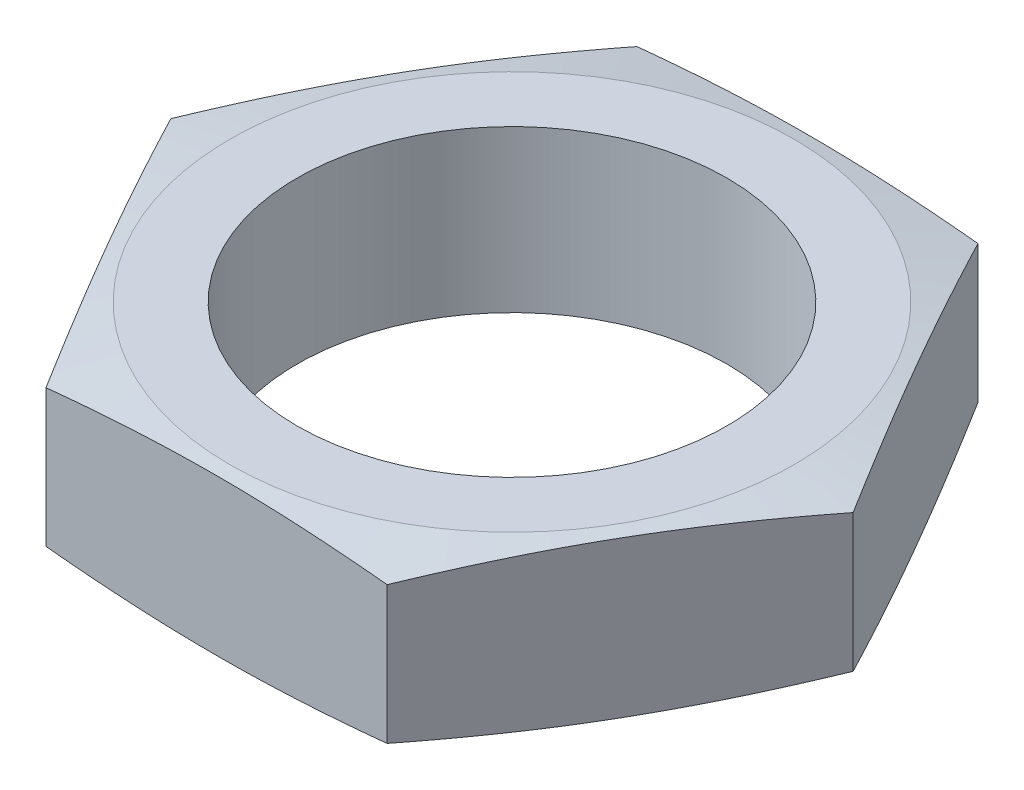
ISO-10303-21;
HEADER;
FILE_DESCRIPTION(('STEP AP214'),'2;1');
FILE_NAME('part.step','',(''),(''),'','','');
FILE_SCHEMA(('AUTOMOTIVE_DESIGN { 1 0 10303 214 1 1 1 1 }'));
ENDSEC;
DATA;
#1=APPLICATION_CONTEXT('core data for automotive mechanical design processes');
#2=APPLICATION_PROTOCOL_DEFINITION('international standard','automotive_design',2000,#1);
#3=PRODUCT_CONTEXT('',#1,'mechanical');
#4=PRODUCT('Part','Part','',(#3));
#5=PRODUCT_RELATED_PRODUCT_CATEGORY('part','',(#4));
#6=PRODUCT_DEFINITION_FORMATION('','',#4);
#7=PRODUCT_DEFINITION_CONTEXT('part definition',#1,'design');
#8=PRODUCT_DEFINITION('design','',#6,#7);
#9=PRODUCT_DEFINITION_SHAPE('','',#8);
#10=(LENGTH_UNIT() NAMED_UNIT(*) SI_UNIT(.MILLI.,.METRE.));
#11=(NAMED_UNIT(*) PLANE_ANGLE_UNIT() SI_UNIT($,.RADIAN.));
#12=(NAMED_UNIT(*) SI_UNIT($,.STERADIAN.) SOLID_ANGLE_UNIT());
#13=UNCERTAINTY_MEASURE_WITH_UNIT(LENGTH_MEASURE(1.E-05),#10,'distance_accuracy_value','');
#14=(GEOMETRIC_REPRESENTATION_CONTEXT(3) GLOBAL_UNCERTAINTY_ASSIGNED_CONTEXT((#13)) GLOBAL_UNIT_ASSIGNED_CONTEXT((#10,
#11,#12)) REPRESENTATION_CONTEXT('',''));
#15=CARTESIAN_POINT('',(0.,0.,0.));
#16=DIRECTION('',(0.,0.,1.));
#17=DIRECTION('',(1.,0.,0.));
#18=AXIS2_PLACEMENT_3D('',#15,#16,#17);
#19=CARTESIAN_POINT('',(-6.35085296108588,3.,11.));
#20=DIRECTION('',(0.,0.,-1.));
#21=DIRECTION('',(-1.,0.,0.));
#22=AXIS2_PLACEMENT_3D('',#19,#20,#21);
#23=PLANE('',#22);
#24=CARTESIAN_POINT('',(-16.7722922137977,-1.08846769373587,11.));
#25=CARTESIAN_POINT('',(-16.2731428790611,-1.17192389600639,11.));
#26=CARTESIAN_POINT('',(-15.773815035147,-1.25433135117265,11.));
#27=CARTESIAN_POINT('',(-14.7747162911989,-1.41649136006859,11.));
#28=CARTESIAN_POINT('',(-14.2749453805329,-1.49624384821549,11.));
#29=CARTESIAN_POINT('',(-13.2746248418894,-1.65257520195712,11.));
#30=CARTESIAN_POINT('',(-12.7740749371449,-1.72915230285825,11.));
#31=CARTESIAN_POINT('',(-11.7723848357964,-1.87834077674984,11.));
#32=CARTESIAN_POINT('',(-11.2712446420702,-1.95095216899286,11.));
#33=CARTESIAN_POINT('',(-10.2704536475722,-2.09098072255144,11.));
#34=CARTESIAN_POINT('',(-9.77080582472987,-2.15841906332748,11.));
#35=CARTESIAN_POINT('',(-8.77074083474428,-2.28731659611422,11.));
#36=CARTESIAN_POINT('',(-8.27032367720687,-2.34877586217311,11.));
#37=CARTESIAN_POINT('',(-7.26867167751493,-2.4643498072554,11.));
#38=CARTESIAN_POINT('',(-6.76743689763973,-2.5184650214607,11.));
#39=CARTESIAN_POINT('',(-5.76407587021504,-2.61778612121701,11.));
#40=CARTESIAN_POINT('',(-5.26194962291346,-2.6629920092452,11.));
#41=CARTESIAN_POINT('',(-4.25377044889399,-2.74305795887612,11.));
#42=CARTESIAN_POINT('',(-3.74771228901958,-2.77785305370227,11.));
#43=CARTESIAN_POINT('',(-2.73489238993153,-2.83510361352437,11.));
#44=CARTESIAN_POINT('',(-2.22813065884094,-2.85755921981686,11.));
#45=CARTESIAN_POINT('',(-1.21430051973899,-2.88890136845049,11.));
#46=CARTESIAN_POINT('',(-0.707232213610055,-2.89779114361509,11.));
#47=CARTESIAN_POINT('',(0.306956331119475,-2.90148064036396,11.));
#48=CARTESIAN_POINT('',(0.814076569683894,-2.89628037169709,11.));
#49=CARTESIAN_POINT('',(1.82900611868858,-2.87207936975535,11.));
#50=CARTESIAN_POINT('',(2.33681475195021,-2.85305078227715,11.));
#51=CARTESIAN_POINT('',(3.35178743836292,-2.80223714818586,11.));
#52=CARTESIAN_POINT('',(3.85895148451142,-2.7704519641577,11.));
#53=CARTESIAN_POINT('',(4.87261174495463,-2.69566930387817,11.));
#54=CARTESIAN_POINT('',(5.37910767647204,-2.6526680513658,11.));
#55=CARTESIAN_POINT('',(6.39119527652248,-2.55718152362848,11.));
#56=CARTESIAN_POINT('',(6.89678694316745,-2.50469622862455,11.));
#57=CARTESIAN_POINT('',(7.87840073102163,-2.3950939405448,11.));
#58=CARTESIAN_POINT('',(8.35447159936608,-2.33840922232469,11.));
#59=CARTESIAN_POINT('',(9.30589720015615,-2.21929115381757,11.));
#60=CARTESIAN_POINT('',(9.78125192090888,-2.15685771068027,11.));
#61=CARTESIAN_POINT('',(10.7313410470661,-2.02727503593882,11.));
#62=CARTESIAN_POINT('',(11.2060754176224,-1.96012555010951,11.));
#63=CARTESIAN_POINT('',(12.1549835611179,-1.82196489425272,11.));
#64=CARTESIAN_POINT('',(12.6291573296849,-1.75095369430813,11.));
#65=CARTESIAN_POINT('',(13.5770998048756,-1.60574910918428,11.));
#66=CARTESIAN_POINT('',(14.0508684274322,-1.53155517672329,11.));
#67=CARTESIAN_POINT('',(14.997988638859,-1.38054774151377,11.));
#68=CARTESIAN_POINT('',(15.4713402262632,-1.30373422959378,11.));
#69=CARTESIAN_POINT('',(16.8908239597901,-1.07006339582943,11.));
#70=CARTESIAN_POINT('',(17.8364231580177,-0.909969863418788,11.));
#71=CARTESIAN_POINT('',(19.7213978754908,-0.584652713470203,11.));
#72=CARTESIAN_POINT('',(20.6607791119927,-0.419462002800291,11.));
#73=CARTESIAN_POINT('',(22.5387809886883,-0.0847616117864468,11.));
#74=CARTESIAN_POINT('',(23.4774016205345,0.0847481153130264,11.));
#75=CARTESIAN_POINT('',(25.3533301149125,0.426816406325102,11.));
#76=CARTESIAN_POINT('',(26.2906384304818,0.599372491966795,11.));
#77=CARTESIAN_POINT('',(28.1647819690706,0.946933839393104,11.));
#78=CARTESIAN_POINT('',(29.1016172011011,1.1219390525533,11.));
#79=CARTESIAN_POINT('',(30.0382883250768,1.29780826690031,11.));
#80=B_SPLINE_CURVE_WITH_KNOTS('',3,(#24,#25,#26,#27,#28,#29,#30,#31,#32,#33,#34,#35,#36,#37,#38,
#39,#40,#41,#42,#43,#44,#45,#46,#47,#48,#49,#50,#51,#52,#53,#54,#55,#56,#57,#58,#59,#60,#61,#62,
#63,#64,#65,#66,#67,#68,#69,#70,#71,#72,#73,#74,#75,#76,#77,#78,#79),.UNSPECIFIED.,.F.,.F.,(4,2,
2,2,2,2,2,2,2,2,2,2,2,2,2,2,2,2,2,2,2,2,2,2,2,2,2,4),(0.,1.51823771290291,3.03651290140394,
4.55562084890165,6.07472142084195,7.58722770584801,9.09971525675225,10.6120925291448,
12.1244693810303,13.6460960345534,15.1677052639269,16.6889518275263,18.21019733858,
19.7345155982005,21.2588502783388,22.7836988401997,24.3085505821687,25.7468102860364,
27.1850932239686,28.623453754237,30.0618254292263,31.500445436424,32.9390704809196,
35.8162049637455,38.6775784631281,41.5389829515007,44.3981580934791,47.2572765503519),.UNSPECIFIED.);
#81=CARTESIAN_POINT('',(6.35085296108589,-2.55965881556565,11.));
#82=VERTEX_POINT('',#81);
#83=CARTESIAN_POINT('',(-6.35085296108588,-2.55965881556565,11.));
#84=VERTEX_POINT('',#83);
#85=EDGE_CURVE('E33',#82,#84,#80,.F.);
#86=ORIENTED_EDGE('',*,*,#85,.F.);
#87=DIRECTION('',(0.,-1.,0.));
#88=VECTOR('',#87,1.);
#89=CARTESIAN_POINT('',(6.35085296108589,3.,11.));
#90=LINE('',#89,#88);
#91=CARTESIAN_POINT('',(6.35085296108589,2.55965881556565,11.));
#92=VERTEX_POINT('',#91);
#93=EDGE_CURVE('E26',#92,#82,#90,.T.);
#94=ORIENTED_EDGE('',*,*,#93,.F.);
#95=CARTESIAN_POINT('',(-16.7722922137977,1.08846769373587,11.));
#96=CARTESIAN_POINT('',(-16.2731428790611,1.17192389600639,11.));
#97=CARTESIAN_POINT('',(-15.773815035147,1.25433135117265,11.));
#98=CARTESIAN_POINT('',(-14.7747162911989,1.41649136006859,11.));
#99=CARTESIAN_POINT('',(-14.2749453805329,1.49624384821549,11.));
#100=CARTESIAN_POINT('',(-13.2746248418894,1.65257520195712,11.));
#101=CARTESIAN_POINT('',(-12.7740749371449,1.72915230285825,11.));
#102=CARTESIAN_POINT('',(-11.7723848357964,1.87834077674984,11.));
#103=CARTESIAN_POINT('',(-11.2712446420702,1.95095216899286,11.));
#104=CARTESIAN_POINT('',(-10.2704536475722,2.09098072255144,11.));
#105=CARTESIAN_POINT('',(-9.77080582472987,2.15841906332748,11.));
#106=CARTESIAN_POINT('',(-8.77074083474428,2.28731659611422,11.));
#107=CARTESIAN_POINT('',(-8.27032367720687,2.34877586217311,11.));
#108=CARTESIAN_POINT('',(-7.26867167751493,2.4643498072554,11.));
#109=CARTESIAN_POINT('',(-6.76743689763973,2.5184650214607,11.));
#110=CARTESIAN_POINT('',(-5.76407587021504,2.61778612121701,11.));
#111=CARTESIAN_POINT('',(-5.26194962291346,2.6629920092452,11.));
#112=CARTESIAN_POINT('',(-4.25377044889399,2.74305795887612,11.));
#113=CARTESIAN_POINT('',(-3.74771228901958,2.77785305370227,11.));
#114=CARTESIAN_POINT('',(-2.73489238993153,2.83510361352437,11.));
#115=CARTESIAN_POINT('',(-2.22813065884094,2.85755921981686,11.));
#116=CARTESIAN_POINT('',(-1.21430051973899,2.88890136845049,11.));
#117=CARTESIAN_POINT('',(-0.707232213610055,2.89779114361509,11.));
#118=CARTESIAN_POINT('',(0.306956331119475,2.90148064036396,11.));
#119=CARTESIAN_POINT('',(0.814076569683894,2.89628037169709,11.));
#120=CARTESIAN_POINT('',(1.82900611868858,2.87207936975535,11.));
#121=CARTESIAN_POINT('',(2.33681475195021,2.85305078227715,11.));
#122=CARTESIAN_POINT('',(3.35178743836292,2.80223714818586,11.));
#123=CARTESIAN_POINT('',(3.85895148451142,2.7704519641577,11.));
#124=CARTESIAN_POINT('',(4.87261174495463,2.69566930387817,11.));
#125=CARTESIAN_POINT('',(5.37910767647204,2.6526680513658,11.));
#126=CARTESIAN_POINT('',(6.39119527652248,2.55718152362848,11.));
#127=CARTESIAN_POINT('',(6.89678694316745,2.50469622862455,11.));
#128=CARTESIAN_POINT('',(7.87840073102163,2.3950939405448,11.));
#129=CARTESIAN_POINT('',(8.35447159936608,2.33840922232469,11.));
#130=CARTESIAN_POINT('',(9.30589720015615,2.21929115381757,11.));
#131=CARTESIAN_POINT('',(9.78125192090888,2.15685771068027,11.));
#132=CARTESIAN_POINT('',(10.7313410470661,2.02727503593882,11.));
#133=CARTESIAN_POINT('',(11.2060754176224,1.96012555010951,11.));
#134=CARTESIAN_POINT('',(12.1549835611179,1.82196489425272,11.));
#135=CARTESIAN_POINT('',(12.6291573296849,1.75095369430813,11.));
#136=CARTESIAN_POINT('',(13.5770998048756,1.60574910918428,11.));
#137=CARTESIAN_POINT('',(14.0508684274322,1.53155517672329,11.));
#138=CARTESIAN_POINT('',(14.997988638859,1.38054774151377,11.));
#139=CARTESIAN_POINT('',(15.4713402262632,1.30373422959378,11.));
#140=CARTESIAN_POINT('',(16.8908239597901,1.07006339582943,11.));
#141=CARTESIAN_POINT('',(17.8364231580177,0.909969863418788,11.));
#142=CARTESIAN_POINT('',(19.7213978754908,0.584652713470203,11.));
#143=CARTESIAN_POINT('',(20.6607791119927,0.419462002800291,11.));
#144=CARTESIAN_POINT('',(22.5387809886883,0.0847616117864468,11.));
#145=CARTESIAN_POINT('',(23.4774016205345,-0.0847481153130264,11.));
#146=CARTESIAN_POINT('',(25.3533301149125,-0.426816406325102,11.));
#147=CARTESIAN_POINT('',(26.2906384304818,-0.599372491966795,11.));
#148=CARTESIAN_POINT('',(28.1647819690706,-0.946933839393104,11.));
#149=CARTESIAN_POINT('',(29.1016172011011,-1.1219390525533,11.));
#150=CARTESIAN_POINT('',(30.0382883250768,-1.29780826690031,11.));
#151=B_SPLINE_CURVE_WITH_KNOTS('',3,(#95,#96,#97,#98,#99,#100,#101,#102,#103,#104,#105,#106,
#107,#108,#109,#110,#111,#112,#113,#114,#115,#116,#117,#118,#119,#120,#121,#122,#123,#124,#125,
#126,#127,#128,#129,#130,#131,#132,#133,#134,#135,#136,#137,#138,#139,#140,#141,#142,#143,#144,
#145,#146,#147,#148,#149,#150),.UNSPECIFIED.,.F.,.F.,(4,2,2,2,2,2,2,2,2,2,2,2,2,2,2,2,2,2,2,2,2,
2,2,2,2,2,2,4),(0.,1.51823771290291,3.03651290140394,4.55562084890165,6.07472142084195,
7.58722770584801,9.09971525675225,10.6120925291448,12.1244693810303,13.6460960345534,
15.1677052639269,16.6889518275263,18.21019733858,19.7345155982005,21.2588502783388,
22.7836988401997,24.3085505821687,25.7468102860364,27.1850932239686,28.623453754237,
30.0618254292263,31.500445436424,32.9390704809196,35.8162049637455,38.6775784631281,
41.5389829515007,44.3981580934791,47.2572765503519),.UNSPECIFIED.);
#152=CARTESIAN_POINT('',(-6.35085296108588,2.55965881556565,11.));
#153=VERTEX_POINT('',#152);
#154=EDGE_CURVE('E151',#153,#92,#151,.T.);
#155=ORIENTED_EDGE('',*,*,#154,.F.);
#156=DIRECTION('',(0.,-1.,0.));
#157=VECTOR('',#156,1.);
#158=CARTESIAN_POINT('',(-6.35085296108588,3.,11.));
#159=LINE('',#158,#157);
#160=EDGE_CURVE('E87',#153,#84,#159,.T.);
#161=ORIENTED_EDGE('',*,*,#160,.T.);
#162=EDGE_LOOP('',(#86,#94,#155,#161));
#163=FACE_BOUND('',#162,.T.);
#164=ADVANCED_FACE('F17',(#163),#23,.F.);
#165=CARTESIAN_POINT('',(6.35085296108589,3.,11.));
#166=DIRECTION('',(-0.866025403784439,0.,-0.5));
#167=DIRECTION('',(-0.5,0.,0.866025403784439));
#168=AXIS2_PLACEMENT_3D('',#165,#166,#167);
#169=PLANE('',#168);
#170=CARTESIAN_POINT('',(12.7018213922256,-2.55963572123997,-0.000200000000004378));
#171=CARTESIAN_POINT('',(12.4376877449327,-2.61248506587701,0.457292897099762));
#172=CARTESIAN_POINT('',(12.1732852687328,-2.66041191030217,0.915251419525077));
#173=CARTESIAN_POINT('',(11.6439595136675,-2.74455346101174,1.83207052105287));
#174=CARTESIAN_POINT('',(11.3790361326985,-2.78076557889539,2.2909312770042));
#175=CARTESIAN_POINT('',(10.849567212286,-2.83950067027059,3.20799834818716));
#176=CARTESIAN_POINT('',(10.5850227887311,-2.8620628466017,3.66620273064335));
#177=CARTESIAN_POINT('',(10.0557453755322,-2.89231173135483,4.5829381016024));
#178=CARTESIAN_POINT('',(9.79101240858053,-2.9,5.0414690508012));
#179=CARTESIAN_POINT('',(9.26154647467713,-2.9,5.9585309491988));
#180=CARTESIAN_POINT('',(8.99681350772543,-2.89231173135483,6.4170618983976));
#181=CARTESIAN_POINT('',(8.46753609452657,-2.8620628466017,7.33379726935665));
#182=CARTESIAN_POINT('',(8.20299167097162,-2.83950067027059,7.79200165181284));
#183=CARTESIAN_POINT('',(7.6735227505592,-2.78076557889539,8.70906872299579));
#184=CARTESIAN_POINT('',(7.40859936959014,-2.74455346101174,9.16792947894713));
#185=CARTESIAN_POINT('',(6.87927361452488,-2.66041191030217,10.0847485804749));
#186=CARTESIAN_POINT('',(6.61487113832494,-2.61248506587701,10.5427071029002));
#187=CARTESIAN_POINT('',(6.35073749103205,-2.55963572123996,11.0002));
#188=B_SPLINE_CURVE_WITH_KNOTS('',3,(#170,#171,#172,#173,#174,#175,#176,#177,#178,#179,#180,
#181,#182,#183,#184,#185,#186,#187),.UNSPECIFIED.,.F.,.F.,(4,2,2,2,2,2,2,2,4),(0.,
1.59275772202257,3.18586712821971,4.77437910673741,6.36272444662769,7.95106978651798,
9.53958176503568,11.1326911712328,12.7254488932554),.UNSPECIFIED.);
#189=CARTESIAN_POINT('',(12.7017059221718,-2.55965881556565,0.));
#190=VERTEX_POINT('',#189);
#191=EDGE_CURVE('E165',#190,#82,#188,.T.);
#192=ORIENTED_EDGE('',*,*,#191,.F.);
#193=DIRECTION('',(0.,-1.,0.));
#194=VECTOR('',#193,1.);
#195=CARTESIAN_POINT('',(12.7017059221718,3.,0.));
#196=LINE('',#195,#194);
#197=CARTESIAN_POINT('',(12.7017059221718,2.55965881556565,0.));
#198=VERTEX_POINT('',#197);
#199=EDGE_CURVE('E97',#198,#190,#196,.T.);
#200=ORIENTED_EDGE('',*,*,#199,.F.);
#201=CARTESIAN_POINT('',(6.35073749103205,2.55963572123997,11.0002));
#202=CARTESIAN_POINT('',(6.61487113832494,2.61248506587701,10.5427071029002));
#203=CARTESIAN_POINT('',(6.87927361452488,2.66041191030217,10.0847485804749));
#204=CARTESIAN_POINT('',(7.40859936959014,2.74455346101174,9.16792947894714));
#205=CARTESIAN_POINT('',(7.6735227505592,2.78076557889539,8.7090687229958));
#206=CARTESIAN_POINT('',(8.20299167097162,2.83950067027059,7.79200165181284));
#207=CARTESIAN_POINT('',(8.46753609452657,2.8620628466017,7.33379726935665));
#208=CARTESIAN_POINT('',(8.99681350772543,2.89231173135483,6.4170618983976));
#209=CARTESIAN_POINT('',(9.26154647467713,2.9,5.9585309491988));
#210=CARTESIAN_POINT('',(9.79101240858053,2.9,5.0414690508012));
#211=CARTESIAN_POINT('',(10.0557453755322,2.89231173135483,4.5829381016024));
#212=CARTESIAN_POINT('',(10.5850227887311,2.8620628466017,3.66620273064335));
#213=CARTESIAN_POINT('',(10.849567212286,2.83950067027059,3.20799834818716));
#214=CARTESIAN_POINT('',(11.3790361326985,2.78076557889539,2.2909312770042));
#215=CARTESIAN_POINT('',(11.6439595136675,2.74455346101174,1.83207052105287));
#216=CARTESIAN_POINT('',(12.1732852687328,2.66041191030217,0.915251419525077));
#217=CARTESIAN_POINT('',(12.4376877449327,2.61248506587701,0.45729289709976));
#218=CARTESIAN_POINT('',(12.7018213922256,2.55963572123997,-0.000200000000004856));
#219=B_SPLINE_CURVE_WITH_KNOTS('',3,(#201,#202,#203,#204,#205,#206,#207,#208,#209,#210,#211,
#212,#213,#214,#215,#216,#217,#218),.UNSPECIFIED.,.F.,.F.,(4,2,2,2,2,2,2,2,4),(0.,
1.59275772202257,3.18586712821971,4.77437910673741,6.36272444662769,7.95106978651798,
9.53958176503568,11.1326911712328,12.7254488932554),.UNSPECIFIED.);
#220=EDGE_CURVE('E146',#92,#198,#219,.T.);
#221=ORIENTED_EDGE('',*,*,#220,.F.);
#222=ORIENTED_EDGE('',*,*,#93,.T.);
#223=EDGE_LOOP('',(#192,#200,#221,#222));
#224=FACE_BOUND('',#223,.T.);
#225=ADVANCED_FACE('F157',(#224),#169,.F.);
#226=CARTESIAN_POINT('',(12.7017059221718,3.,0.));
#227=DIRECTION('',(-0.866025403784439,0.,0.5));
#228=DIRECTION('',(0.5,0.,0.866025403784439));
#229=AXIS2_PLACEMENT_3D('',#226,#227,#228);
#230=PLANE('',#229);
#231=CARTESIAN_POINT('',(6.35073749103205,-2.55963572123996,-11.0002));
#232=CARTESIAN_POINT('',(6.61487113832494,-2.61248506587701,-10.5427071029002));
#233=CARTESIAN_POINT('',(6.87927361452487,-2.66041191030217,-10.0847485804749));
#234=CARTESIAN_POINT('',(7.40859936959013,-2.74455346101174,-9.16792947894713));
#235=CARTESIAN_POINT('',(7.67352275055919,-2.7807655788954,-8.70906872299579));
#236=CARTESIAN_POINT('',(8.20299167097161,-2.83950067027059,-7.79200165181284));
#237=CARTESIAN_POINT('',(8.46753609452656,-2.8620628466017,-7.33379726935664));
#238=CARTESIAN_POINT('',(8.99681350772542,-2.89231173135484,-6.4170618983976));
#239=CARTESIAN_POINT('',(9.26154647467712,-2.9,-5.9585309491988));
#240=CARTESIAN_POINT('',(9.79101240858052,-2.9,-5.0414690508012));
#241=CARTESIAN_POINT('',(10.0557453755322,-2.89231173135484,-4.5829381016024));
#242=CARTESIAN_POINT('',(10.5850227887311,-2.8620628466017,-3.66620273064336));
#243=CARTESIAN_POINT('',(10.849567212286,-2.83950067027059,-3.20799834818716));
#244=CARTESIAN_POINT('',(11.3790361326985,-2.7807655788954,-2.29093127700421));
#245=CARTESIAN_POINT('',(11.6439595136675,-2.74455346101174,-1.83207052105287));
#246=CARTESIAN_POINT('',(12.1732852687328,-2.66041191030218,-0.91525141952508));
#247=CARTESIAN_POINT('',(12.4376877449327,-2.61248506587702,-0.457292897099766));
#248=CARTESIAN_POINT('',(12.7018213922256,-2.55963572123997,0.000199999999995751));
#249=B_SPLINE_CURVE_WITH_KNOTS('',3,(#231,#232,#233,#234,#235,#236,#237,#238,#239,#240,#241,
#242,#243,#244,#245,#246,#247,#248),.UNSPECIFIED.,.F.,.F.,(4,2,2,2,2,2,2,2,4),(0.,
1.59275772202257,3.18586712821971,4.77437910673741,6.36272444662769,7.95106978651797,
9.53958176503567,11.1326911712328,12.7254488932554),.UNSPECIFIED.);
#250=CARTESIAN_POINT('',(6.35085296108588,-2.55965881556565,-11.));
#251=VERTEX_POINT('',#250);
#252=EDGE_CURVE('E171',#251,#190,#249,.T.);
#253=ORIENTED_EDGE('',*,*,#252,.F.);
#254=DIRECTION('',(0.,-1.,0.));
#255=VECTOR('',#254,1.);
#256=CARTESIAN_POINT('',(6.35085296108588,3.,-11.));
#257=LINE('',#256,#255);
#258=CARTESIAN_POINT('',(6.35085296108588,2.55965881556565,-11.));
#259=VERTEX_POINT('',#258);
#260=EDGE_CURVE('E89',#259,#251,#257,.T.);
#261=ORIENTED_EDGE('',*,*,#260,.F.);
#262=CARTESIAN_POINT('',(12.7018213922256,2.55963572123997,0.000199999999996144));
#263=CARTESIAN_POINT('',(12.4376877449327,2.61248506587702,-0.457292897099764));
#264=CARTESIAN_POINT('',(12.1732852687328,2.66041191030218,-0.915251419525079));
#265=CARTESIAN_POINT('',(11.6439595136675,2.74455346101174,-1.83207052105287));
#266=CARTESIAN_POINT('',(11.3790361326985,2.7807655788954,-2.29093127700421));
#267=CARTESIAN_POINT('',(10.849567212286,2.83950067027059,-3.20799834818716));
#268=CARTESIAN_POINT('',(10.5850227887311,2.8620628466017,-3.66620273064336));
#269=CARTESIAN_POINT('',(10.0557453755322,2.89231173135484,-4.5829381016024));
#270=CARTESIAN_POINT('',(9.79101240858052,2.9,-5.0414690508012));
#271=CARTESIAN_POINT('',(9.26154647467712,2.9,-5.9585309491988));
#272=CARTESIAN_POINT('',(8.99681350772542,2.89231173135484,-6.4170618983976));
#273=CARTESIAN_POINT('',(8.46753609452656,2.8620628466017,-7.33379726935664));
#274=CARTESIAN_POINT('',(8.20299167097162,2.83950067027059,-7.79200165181284));
#275=CARTESIAN_POINT('',(7.67352275055919,2.7807655788954,-8.70906872299579));
#276=CARTESIAN_POINT('',(7.40859936959013,2.74455346101174,-9.16792947894713));
#277=CARTESIAN_POINT('',(6.87927361452487,2.66041191030217,-10.0847485804749));
#278=CARTESIAN_POINT('',(6.61487113832493,2.61248506587701,-10.5427071029002));
#279=CARTESIAN_POINT('',(6.35073749103205,2.55963572123996,-11.0002));
#280=B_SPLINE_CURVE_WITH_KNOTS('',3,(#262,#263,#264,#265,#266,#267,#268,#269,#270,#271,#272,
#273,#274,#275,#276,#277,#278,#279),.UNSPECIFIED.,.F.,.F.,(4,2,2,2,2,2,2,2,4),(0.,
1.59275772202257,3.18586712821971,4.77437910673741,6.36272444662769,7.95106978651797,
9.53958176503567,11.1326911712328,12.7254488932554),.UNSPECIFIED.);
#281=EDGE_CURVE('E139',#198,#259,#280,.T.);
#282=ORIENTED_EDGE('',*,*,#281,.F.);
#283=ORIENTED_EDGE('',*,*,#199,.T.);
#284=EDGE_LOOP('',(#253,#261,#282,#283));
#285=FACE_BOUND('',#284,.T.);
#286=ADVANCED_FACE('F160',(#285),#230,.F.);
#287=CARTESIAN_POINT('',(6.35085296108588,3.,-11.));
#288=DIRECTION('',(0.,0.,1.));
#289=DIRECTION('',(1.,0.,0.));
#290=AXIS2_PLACEMENT_3D('',#287,#288,#289);
#291=PLANE('',#290);
#292=CARTESIAN_POINT('',(-16.7722922137977,-1.08846769373587,-11.));
#293=CARTESIAN_POINT('',(-16.2731428790611,-1.17192389600639,-11.));
#294=CARTESIAN_POINT('',(-15.773815035147,-1.25433135117265,-11.));
#295=CARTESIAN_POINT('',(-14.7747162911989,-1.41649136006859,-11.));
#296=CARTESIAN_POINT('',(-14.2749453805329,-1.49624384821549,-11.));
#297=CARTESIAN_POINT('',(-13.2746248418894,-1.65257520195712,-11.));
#298=CARTESIAN_POINT('',(-12.7740749371449,-1.72915230285825,-11.));
#299=CARTESIAN_POINT('',(-11.7723848357964,-1.87834077674985,-11.));
#300=CARTESIAN_POINT('',(-11.2712446420702,-1.95095216899286,-11.));
#301=CARTESIAN_POINT('',(-10.2704536475722,-2.09098072255144,-11.));
#302=CARTESIAN_POINT('',(-9.77080582472987,-2.15841906332748,-11.));
#303=CARTESIAN_POINT('',(-8.77074083474428,-2.28731659611423,-11.));
#304=CARTESIAN_POINT('',(-8.27032367720687,-2.34877586217311,-11.));
#305=CARTESIAN_POINT('',(-7.26867167751493,-2.4643498072554,-11.));
#306=CARTESIAN_POINT('',(-6.76743689763973,-2.5184650214607,-11.));
#307=CARTESIAN_POINT('',(-5.76407587021504,-2.61778612121701,-11.));
#308=CARTESIAN_POINT('',(-5.26194962291346,-2.6629920092452,-11.));
#309=CARTESIAN_POINT('',(-4.25377044889399,-2.74305795887612,-11.));
#310=CARTESIAN_POINT('',(-3.74771228901958,-2.77785305370228,-11.));
#311=CARTESIAN_POINT('',(-2.73489238993153,-2.83510361352437,-11.));
#312=CARTESIAN_POINT('',(-2.22813065884094,-2.85755921981686,-11.));
#313=CARTESIAN_POINT('',(-1.21430051973899,-2.88890136845049,-11.));
#314=CARTESIAN_POINT('',(-0.707232213610056,-2.89779114361509,-11.));
#315=CARTESIAN_POINT('',(0.306956331119473,-2.90148064036396,-11.));
#316=CARTESIAN_POINT('',(0.814076569683891,-2.89628037169709,-11.));
#317=CARTESIAN_POINT('',(1.82900611868858,-2.87207936975535,-11.));
#318=CARTESIAN_POINT('',(2.3368147519502,-2.85305078227715,-11.));
#319=CARTESIAN_POINT('',(3.35178743836291,-2.80223714818586,-11.));
#320=CARTESIAN_POINT('',(3.85895148451141,-2.7704519641577,-11.));
#321=CARTESIAN_POINT('',(4.87261174495463,-2.69566930387817,-11.));
#322=CARTESIAN_POINT('',(5.37910767647203,-2.6526680513658,-11.));
#323=CARTESIAN_POINT('',(6.39119527652247,-2.55718152362847,-11.));
#324=CARTESIAN_POINT('',(6.89678694316744,-2.50469622862455,-11.));
#325=CARTESIAN_POINT('',(7.87840073102162,-2.3950939405448,-11.));
#326=CARTESIAN_POINT('',(8.35447159936607,-2.33840922232469,-11.));
#327=CARTESIAN_POINT('',(9.30589720015614,-2.21929115381756,-11.));
#328=CARTESIAN_POINT('',(9.78125192090887,-2.15685771068027,-11.));
#329=CARTESIAN_POINT('',(10.7313410470661,-2.02727503593882,-11.));
#330=CARTESIAN_POINT('',(11.2060754176224,-1.96012555010951,-11.));
#331=CARTESIAN_POINT('',(12.1549835611179,-1.82196489425272,-11.));
#332=CARTESIAN_POINT('',(12.6291573296849,-1.75095369430813,-11.));
#333=CARTESIAN_POINT('',(13.5770998048756,-1.60574910918428,-11.));
#334=CARTESIAN_POINT('',(14.0508684274322,-1.53155517672329,-11.));
#335=CARTESIAN_POINT('',(14.997988638859,-1.38054774151377,-11.));
#336=CARTESIAN_POINT('',(15.4713402262632,-1.30373422959378,-11.));
#337=CARTESIAN_POINT('',(16.8908239597901,-1.07006339582943,-11.));
#338=CARTESIAN_POINT('',(17.8364231580177,-0.909969863418786,-11.));
#339=CARTESIAN_POINT('',(19.7213978754908,-0.584652713470202,-11.));
#340=CARTESIAN_POINT('',(20.6607791119927,-0.41946200280029,-11.));
#341=CARTESIAN_POINT('',(22.5387809886883,-0.0847616117864463,-11.));
#342=CARTESIAN_POINT('',(23.4774016205345,0.0847481153130269,-11.));
#343=CARTESIAN_POINT('',(25.3533301149124,0.426816406325102,-11.));
#344=CARTESIAN_POINT('',(26.2906384304818,0.599372491966794,-11.));
#345=CARTESIAN_POINT('',(28.1647819690706,0.946933839393103,-11.));
#346=CARTESIAN_POINT('',(29.1016172011011,1.1219390525533,-11.));
#347=CARTESIAN_POINT('',(30.0382883250768,1.29780826690031,-11.));
#348=B_SPLINE_CURVE_WITH_KNOTS('',3,(#292,#293,#294,#295,#296,#297,#298,#299,#300,#301,#302,
#303,#304,#305,#306,#307,#308,#309,#310,#311,#312,#313,#314,#315,#316,#317,#318,#319,#320,#321,
#322,#323,#324,#325,#326,#327,#328,#329,#330,#331,#332,#333,#334,#335,#336,#337,#338,#339,#340,
#341,#342,#343,#344,#345,#346,#347),.UNSPECIFIED.,.F.,.F.,(4,2,2,2,2,2,2,2,2,2,2,2,2,2,2,2,2,2,
2,2,2,2,2,2,2,2,2,4),(0.,1.51823771290291,3.03651290140394,4.55562084890165,6.07472142084195,
7.58722770584801,9.09971525675225,10.6120925291448,12.1244693810303,13.6460960345534,
15.1677052639269,16.6889518275263,18.21019733858,19.7345155982005,21.2588502783388,
22.7836988401997,24.3085505821687,25.7468102860364,27.1850932239686,28.623453754237,
30.0618254292262,31.500445436424,32.9390704809196,35.8162049637455,38.6775784631281,
41.5389829515007,44.3981580934791,47.2572765503519),.UNSPECIFIED.);
#349=CARTESIAN_POINT('',(-6.35085296108588,-2.55965881556565,-11.));
#350=VERTEX_POINT('',#349);
#351=EDGE_CURVE('E84',#350,#251,#348,.T.);
#352=ORIENTED_EDGE('',*,*,#351,.F.);
#353=DIRECTION('',(0.,-1.,0.));
#354=VECTOR('',#353,1.);
#355=CARTESIAN_POINT('',(-6.35085296108588,3.,-11.));
#356=LINE('',#355,#354);
#357=CARTESIAN_POINT('',(-6.35085296108588,2.55965881556565,-11.));
#358=VERTEX_POINT('',#357);
#359=EDGE_CURVE('E83',#358,#350,#356,.T.);
#360=ORIENTED_EDGE('',*,*,#359,.F.);
#361=CARTESIAN_POINT('',(-16.7722922137977,1.08846769373587,-11.));
#362=CARTESIAN_POINT('',(-16.2731428790611,1.17192389600639,-11.));
#363=CARTESIAN_POINT('',(-15.773815035147,1.25433135117265,-11.));
#364=CARTESIAN_POINT('',(-14.7747162911989,1.41649136006859,-11.));
#365=CARTESIAN_POINT('',(-14.2749453805329,1.49624384821549,-11.));
#366=CARTESIAN_POINT('',(-13.2746248418894,1.65257520195712,-11.));
#367=CARTESIAN_POINT('',(-12.7740749371449,1.72915230285825,-11.));
#368=CARTESIAN_POINT('',(-11.7723848357964,1.87834077674985,-11.));
#369=CARTESIAN_POINT('',(-11.2712446420702,1.95095216899286,-11.));
#370=CARTESIAN_POINT('',(-10.2704536475722,2.09098072255144,-11.));
#371=CARTESIAN_POINT('',(-9.77080582472987,2.15841906332748,-11.));
#372=CARTESIAN_POINT('',(-8.77074083474428,2.28731659611423,-11.));
#373=CARTESIAN_POINT('',(-8.27032367720687,2.34877586217311,-11.));
#374=CARTESIAN_POINT('',(-7.26867167751493,2.4643498072554,-11.));
#375=CARTESIAN_POINT('',(-6.76743689763973,2.5184650214607,-11.));
#376=CARTESIAN_POINT('',(-5.76407587021504,2.61778612121701,-11.));
#377=CARTESIAN_POINT('',(-5.26194962291346,2.6629920092452,-11.));
#378=CARTESIAN_POINT('',(-4.25377044889399,2.74305795887612,-11.));
#379=CARTESIAN_POINT('',(-3.74771228901958,2.77785305370228,-11.));
#380=CARTESIAN_POINT('',(-2.73489238993153,2.83510361352437,-11.));
#381=CARTESIAN_POINT('',(-2.22813065884094,2.85755921981686,-11.));
#382=CARTESIAN_POINT('',(-1.21430051973899,2.88890136845049,-11.));
#383=CARTESIAN_POINT('',(-0.707232213610056,2.89779114361509,-11.));
#384=CARTESIAN_POINT('',(0.306956331119473,2.90148064036396,-11.));
#385=CARTESIAN_POINT('',(0.814076569683891,2.89628037169709,-11.));
#386=CARTESIAN_POINT('',(1.82900611868858,2.87207936975535,-11.));
#387=CARTESIAN_POINT('',(2.3368147519502,2.85305078227715,-11.));
#388=CARTESIAN_POINT('',(3.35178743836291,2.80223714818586,-11.));
#389=CARTESIAN_POINT('',(3.85895148451141,2.7704519641577,-11.));
#390=CARTESIAN_POINT('',(4.87261174495463,2.69566930387817,-11.));
#391=CARTESIAN_POINT('',(5.37910767647203,2.6526680513658,-11.));
#392=CARTESIAN_POINT('',(6.39119527652247,2.55718152362847,-11.));
#393=CARTESIAN_POINT('',(6.89678694316744,2.50469622862455,-11.));
#394=CARTESIAN_POINT('',(7.87840073102162,2.3950939405448,-11.));
#395=CARTESIAN_POINT('',(8.35447159936607,2.33840922232469,-11.));
#396=CARTESIAN_POINT('',(9.30589720015614,2.21929115381756,-11.));
#397=CARTESIAN_POINT('',(9.78125192090887,2.15685771068027,-11.));
#398=CARTESIAN_POINT('',(10.7313410470661,2.02727503593882,-11.));
#399=CARTESIAN_POINT('',(11.2060754176224,1.96012555010951,-11.));
#400=CARTESIAN_POINT('',(12.1549835611179,1.82196489425272,-11.));
#401=CARTESIAN_POINT('',(12.6291573296849,1.75095369430813,-11.));
#402=CARTESIAN_POINT('',(13.5770998048756,1.60574910918428,-11.));
#403=CARTESIAN_POINT('',(14.0508684274322,1.53155517672329,-11.));
#404=CARTESIAN_POINT('',(14.997988638859,1.38054774151377,-11.));
#405=CARTESIAN_POINT('',(15.4713402262632,1.30373422959378,-11.));
#406=CARTESIAN_POINT('',(16.8908239597901,1.07006339582943,-11.));
#407=CARTESIAN_POINT('',(17.8364231580177,0.909969863418786,-11.));
#408=CARTESIAN_POINT('',(19.7213978754908,0.584652713470202,-11.));
#409=CARTESIAN_POINT('',(20.6607791119927,0.41946200280029,-11.));
#410=CARTESIAN_POINT('',(22.5387809886883,0.0847616117864463,-11.));
#411=CARTESIAN_POINT('',(23.4774016205345,-0.0847481153130269,-11.));
#412=CARTESIAN_POINT('',(25.3533301149124,-0.426816406325102,-11.));
#413=CARTESIAN_POINT('',(26.2906384304818,-0.599372491966794,-11.));
#414=CARTESIAN_POINT('',(28.1647819690706,-0.946933839393103,-11.));
#415=CARTESIAN_POINT('',(29.1016172011011,-1.1219390525533,-11.));
#416=CARTESIAN_POINT('',(30.0382883250768,-1.29780826690031,-11.));
#417=B_SPLINE_CURVE_WITH_KNOTS('',3,(#361,#362,#363,#364,#365,#366,#367,#368,#369,#370,#371,
#372,#373,#374,#375,#376,#377,#378,#379,#380,#381,#382,#383,#384,#385,#386,#387,#388,#389,#390,
#391,#392,#393,#394,#395,#396,#397,#398,#399,#400,#401,#402,#403,#404,#405,#406,#407,#408,#409,
#410,#411,#412,#413,#414,#415,#416),.UNSPECIFIED.,.F.,.F.,(4,2,2,2,2,2,2,2,2,2,2,2,2,2,2,2,2,2,
2,2,2,2,2,2,2,2,2,4),(0.,1.51823771290291,3.03651290140394,4.55562084890165,6.07472142084195,
7.58722770584801,9.09971525675225,10.6120925291448,12.1244693810303,13.6460960345534,
15.1677052639269,16.6889518275263,18.21019733858,19.7345155982005,21.2588502783388,
22.7836988401997,24.3085505821687,25.7468102860364,27.1850932239686,28.623453754237,
30.0618254292262,31.500445436424,32.9390704809196,35.8162049637455,38.6775784631281,
41.5389829515007,44.3981580934791,47.2572765503519),.UNSPECIFIED.);
#418=EDGE_CURVE('E132',#259,#358,#417,.F.);
#419=ORIENTED_EDGE('',*,*,#418,.F.);
#420=ORIENTED_EDGE('',*,*,#260,.T.);
#421=EDGE_LOOP('',(#352,#360,#419,#420));
#422=FACE_BOUND('',#421,.T.);
#423=ADVANCED_FACE('F188',(#422),#291,.F.);
#424=CARTESIAN_POINT('',(-6.35085296108588,3.,-11.));
#425=DIRECTION('',(0.866025403784439,0.,0.5));
#426=DIRECTION('',(0.5,0.,-0.866025403784439));
#427=AXIS2_PLACEMENT_3D('',#424,#425,#426);
#428=PLANE('',#427);
#429=CARTESIAN_POINT('',(-12.7018213922256,-2.55963572123997,0.000200000000002168));
#430=CARTESIAN_POINT('',(-12.4376877449327,-2.61248506587702,-0.457292897099757));
#431=CARTESIAN_POINT('',(-12.1732852687328,-2.66041191030217,-0.915251419525073));
#432=CARTESIAN_POINT('',(-11.6439595136675,-2.74455346101174,-1.83207052105286));
#433=CARTESIAN_POINT('',(-11.3790361326985,-2.78076557889539,-2.2909312770042));
#434=CARTESIAN_POINT('',(-10.849567212286,-2.83950067027059,-3.20799834818716));
#435=CARTESIAN_POINT('',(-10.5850227887311,-2.8620628466017,-3.66620273064335));
#436=CARTESIAN_POINT('',(-10.0557453755322,-2.89231173135484,-4.58293810160239));
#437=CARTESIAN_POINT('',(-9.79101240858053,-2.9,-5.0414690508012));
#438=CARTESIAN_POINT('',(-9.26154647467712,-2.9,-5.9585309491988));
#439=CARTESIAN_POINT('',(-8.99681350772542,-2.89231173135484,-6.4170618983976));
#440=CARTESIAN_POINT('',(-8.46753609452656,-2.8620628466017,-7.33379726935664));
#441=CARTESIAN_POINT('',(-8.20299167097162,-2.83950067027059,-7.79200165181283));
#442=CARTESIAN_POINT('',(-7.67352275055919,-2.7807655788954,-8.70906872299579));
#443=CARTESIAN_POINT('',(-7.40859936959013,-2.74455346101174,-9.16792947894713));
#444=CARTESIAN_POINT('',(-6.87927361452487,-2.66041191030217,-10.0847485804749));
#445=CARTESIAN_POINT('',(-6.61487113832493,-2.61248506587701,-10.5427071029002));
#446=CARTESIAN_POINT('',(-6.35073749103205,-2.55963572123997,-11.0002));
#447=B_SPLINE_CURVE_WITH_KNOTS('',3,(#429,#430,#431,#432,#433,#434,#435,#436,#437,#438,#439,
#440,#441,#442,#443,#444,#445,#446),.UNSPECIFIED.,.F.,.F.,(4,2,2,2,2,2,2,2,4),(0.,
1.59275772202257,3.18586712821971,4.77437910673741,6.36272444662769,7.95106978651797,
9.53958176503567,11.1326911712328,12.7254488932554),.UNSPECIFIED.);
#448=CARTESIAN_POINT('',(-12.7017059221718,-2.55965881556565,0.));
#449=VERTEX_POINT('',#448);
#450=EDGE_CURVE('E70',#449,#350,#447,.T.);
#451=ORIENTED_EDGE('',*,*,#450,.F.);
#452=DIRECTION('',(0.,-1.,0.));
#453=VECTOR('',#452,1.);
#454=CARTESIAN_POINT('',(-12.7017059221718,3.,0.));
#455=LINE('',#454,#453);
#456=CARTESIAN_POINT('',(-12.7017059221718,2.55965881556565,0.));
#457=VERTEX_POINT('',#456);
#458=EDGE_CURVE('E81',#457,#449,#455,.T.);
#459=ORIENTED_EDGE('',*,*,#458,.F.);
#460=CARTESIAN_POINT('',(-6.35073749103205,2.55963572123997,-11.0002));
#461=CARTESIAN_POINT('',(-6.61487113832493,2.61248506587701,-10.5427071029002));
#462=CARTESIAN_POINT('',(-6.87927361452487,2.66041191030217,-10.0847485804749));
#463=CARTESIAN_POINT('',(-7.40859936959013,2.74455346101174,-9.16792947894713));
#464=CARTESIAN_POINT('',(-7.67352275055919,2.7807655788954,-8.70906872299579));
#465=CARTESIAN_POINT('',(-8.20299167097162,2.83950067027059,-7.79200165181283));
#466=CARTESIAN_POINT('',(-8.46753609452656,2.8620628466017,-7.33379726935664));
#467=CARTESIAN_POINT('',(-8.99681350772542,2.89231173135484,-6.4170618983976));
#468=CARTESIAN_POINT('',(-9.26154647467712,2.9,-5.9585309491988));
#469=CARTESIAN_POINT('',(-9.79101240858053,2.9,-5.04146905080119));
#470=CARTESIAN_POINT('',(-10.0557453755322,2.89231173135484,-4.58293810160239));
#471=CARTESIAN_POINT('',(-10.5850227887311,2.8620628466017,-3.66620273064335));
#472=CARTESIAN_POINT('',(-10.849567212286,2.83950067027059,-3.20799834818716));
#473=CARTESIAN_POINT('',(-11.3790361326985,2.78076557889539,-2.2909312770042));
#474=CARTESIAN_POINT('',(-11.6439595136675,2.74455346101174,-1.83207052105286));
#475=CARTESIAN_POINT('',(-12.1732852687328,2.66041191030217,-0.915251419525073));
#476=CARTESIAN_POINT('',(-12.4376877449327,2.61248506587702,-0.457292897099758));
#477=CARTESIAN_POINT('',(-12.7018213922256,2.55963572123997,0.000200000000001632));
#478=B_SPLINE_CURVE_WITH_KNOTS('',3,(#460,#461,#462,#463,#464,#465,#466,#467,#468,#469,#470,
#471,#472,#473,#474,#475,#476,#477),.UNSPECIFIED.,.F.,.F.,(4,2,2,2,2,2,2,2,4),(0.,
1.59275772202257,3.18586712821971,4.77437910673741,6.36272444662769,7.95106978651798,
9.53958176503568,11.1326911712328,12.7254488932554),.UNSPECIFIED.);
#479=EDGE_CURVE('E40',#358,#457,#478,.T.);
#480=ORIENTED_EDGE('',*,*,#479,.F.);
#481=ORIENTED_EDGE('',*,*,#359,.T.);
#482=EDGE_LOOP('',(#451,#459,#480,#481));
#483=FACE_BOUND('',#482,.T.);
#484=ADVANCED_FACE('F80',(#483),#428,.F.);
#485=CARTESIAN_POINT('',(-12.7017059221718,3.,0.));
#486=DIRECTION('',(0.866025403784438,0.,-0.5));
#487=DIRECTION('',(-0.5,0.,-0.866025403784439));
#488=AXIS2_PLACEMENT_3D('',#485,#486,#487);
#489=PLANE('',#488);
#490=CARTESIAN_POINT('',(-6.35073749103204,-2.55963572123997,11.0002));
#491=CARTESIAN_POINT('',(-6.61487113832493,-2.61248506587701,10.5427071029002));
#492=CARTESIAN_POINT('',(-6.87927361452486,-2.66041191030217,10.0847485804749));
#493=CARTESIAN_POINT('',(-7.40859936959012,-2.74455346101174,9.16792947894713));
#494=CARTESIAN_POINT('',(-7.67352275055918,-2.7807655788954,8.70906872299579));
#495=CARTESIAN_POINT('',(-8.20299167097161,-2.83950067027059,7.79200165181284));
#496=CARTESIAN_POINT('',(-8.46753609452656,-2.8620628466017,7.33379726935665));
#497=CARTESIAN_POINT('',(-8.99681350772541,-2.89231173135484,6.4170618983976));
#498=CARTESIAN_POINT('',(-9.26154647467711,-2.9,5.9585309491988));
#499=CARTESIAN_POINT('',(-9.79101240858052,-2.9,5.0414690508012));
#500=CARTESIAN_POINT('',(-10.0557453755322,-2.89231173135484,4.5829381016024));
#501=CARTESIAN_POINT('',(-10.5850227887311,-2.8620628466017,3.66620273064336));
#502=CARTESIAN_POINT('',(-10.849567212286,-2.83950067027059,3.20799834818716));
#503=CARTESIAN_POINT('',(-11.3790361326984,-2.7807655788954,2.29093127700421));
#504=CARTESIAN_POINT('',(-11.6439595136675,-2.74455346101174,1.83207052105287));
#505=CARTESIAN_POINT('',(-12.1732852687328,-2.66041191030218,0.915251419525079));
#506=CARTESIAN_POINT('',(-12.4376877449327,-2.61248506587702,0.457292897099764));
#507=CARTESIAN_POINT('',(-12.7018213922256,-2.55963572123997,-0.000199999999996741));
#508=B_SPLINE_CURVE_WITH_KNOTS('',3,(#490,#491,#492,#493,#494,#495,#496,#497,#498,#499,#500,
#501,#502,#503,#504,#505,#506,#507),.UNSPECIFIED.,.F.,.F.,(4,2,2,2,2,2,2,2,4),(0.,
1.59275772202257,3.18586712821971,4.77437910673741,6.36272444662769,7.95106978651798,
9.53958176503568,11.1326911712328,12.7254488932554),.UNSPECIFIED.);
#509=EDGE_CURVE('E67',#84,#449,#508,.T.);
#510=ORIENTED_EDGE('',*,*,#509,.F.);
#511=ORIENTED_EDGE('',*,*,#160,.F.);
#512=CARTESIAN_POINT('',(-12.7018213922256,2.55963572123997,-0.000199999999997869));
#513=CARTESIAN_POINT('',(-12.4376877449327,2.61248506587701,0.457292897099762));
#514=CARTESIAN_POINT('',(-12.1732852687328,2.66041191030217,0.915251419525077));
#515=CARTESIAN_POINT('',(-11.6439595136675,2.74455346101174,1.83207052105287));
#516=CARTESIAN_POINT('',(-11.3790361326984,2.7807655788954,2.29093127700421));
#517=CARTESIAN_POINT('',(-10.849567212286,2.83950067027059,3.20799834818716));
#518=CARTESIAN_POINT('',(-10.5850227887311,2.8620628466017,3.66620273064336));
#519=CARTESIAN_POINT('',(-10.0557453755322,2.89231173135484,4.5829381016024));
#520=CARTESIAN_POINT('',(-9.79101240858052,2.9,5.0414690508012));
#521=CARTESIAN_POINT('',(-9.26154647467711,2.9,5.9585309491988));
#522=CARTESIAN_POINT('',(-8.99681350772541,2.89231173135484,6.4170618983976));
#523=CARTESIAN_POINT('',(-8.46753609452656,2.8620628466017,7.33379726935665));
#524=CARTESIAN_POINT('',(-8.20299167097161,2.83950067027059,7.79200165181284));
#525=CARTESIAN_POINT('',(-7.67352275055918,2.7807655788954,8.70906872299579));
#526=CARTESIAN_POINT('',(-7.40859936959012,2.74455346101174,9.16792947894713));
#527=CARTESIAN_POINT('',(-6.87927361452486,2.66041191030217,10.0847485804749));
#528=CARTESIAN_POINT('',(-6.61487113832493,2.61248506587701,10.5427071029002));
#529=CARTESIAN_POINT('',(-6.35073749103204,2.55963572123997,11.0002));
#530=B_SPLINE_CURVE_WITH_KNOTS('',3,(#512,#513,#514,#515,#516,#517,#518,#519,#520,#521,#522,
#523,#524,#525,#526,#527,#528,#529),.UNSPECIFIED.,.F.,.F.,(4,2,2,2,2,2,2,2,4),(0.,
1.59275772202257,3.18586712821971,4.77437910673741,6.3627244466277,7.95106978651798,
9.53958176503568,11.1326911712328,12.7254488932554),.UNSPECIFIED.);
#531=EDGE_CURVE('E11',#457,#153,#530,.T.);
#532=ORIENTED_EDGE('',*,*,#531,.F.);
#533=ORIENTED_EDGE('',*,*,#458,.T.);
#534=EDGE_LOOP('',(#510,#511,#532,#533));
#535=FACE_BOUND('',#534,.T.);
#536=ADVANCED_FACE('F86',(#535),#489,.F.);
#537=CARTESIAN_POINT('',(0.,-3.,0.));
#538=DIRECTION('',(0.,1.,0.));
#539=DIRECTION('',(0.,0.,1.));
#540=AXIS2_PLACEMENT_3D('',#537,#538,#539);
#541=PLANE('',#540);
#542=CARTESIAN_POINT('',(0.,-3.,0.));
#543=DIRECTION('',(0.,1.,0.));
#544=DIRECTION('',(0.,0.,1.));
#545=AXIS2_PLACEMENT_3D('',#542,#543,#544);
#546=CIRCLE('',#545,8.);
#547=CARTESIAN_POINT('',(0.,-3.,8.));
#548=VERTEX_POINT('',#547);
#549=EDGE_CURVE('E218',#548,#548,#546,.T.);
#550=ORIENTED_EDGE('',*,*,#549,.T.);
#551=EDGE_LOOP('',(#550));
#552=FACE_BOUND('',#551,.T.);
#553=CARTESIAN_POINT('',(0.,-3.,0.));
#554=DIRECTION('',(0.,1.,0.));
#555=DIRECTION('',(0.,0.,1.));
#556=AXIS2_PLACEMENT_3D('',#553,#554,#555);
#557=CIRCLE('',#556,10.5);
#558=CARTESIAN_POINT('',(0.,-3.,10.5));
#559=VERTEX_POINT('',#558);
#560=EDGE_CURVE('E21',#559,#559,#557,.T.);
#561=ORIENTED_EDGE('',*,*,#560,.F.);
#562=EDGE_LOOP('',(#561));
#563=FACE_BOUND('',#562,.T.);
#564=ADVANCED_FACE('F209',(#552,#563),#541,.F.);
#565=CARTESIAN_POINT('',(0.,3.,0.));
#566=DIRECTION('',(0.,1.,0.));
#567=DIRECTION('',(0.,0.,1.));
#568=AXIS2_PLACEMENT_3D('',#565,#566,#567);
#569=PLANE('',#568);
#570=CARTESIAN_POINT('',(0.,3.,0.));
#571=DIRECTION('',(0.,1.,0.));
#572=DIRECTION('',(0.,0.,1.));
#573=AXIS2_PLACEMENT_3D('',#570,#571,#572);
#574=CIRCLE('',#573,8.);
#575=CARTESIAN_POINT('',(0.,3.,8.));
#576=VERTEX_POINT('',#575);
#577=EDGE_CURVE('E91',#576,#576,#574,.T.);
#578=ORIENTED_EDGE('',*,*,#577,.F.);
#579=EDGE_LOOP('',(#578));
#580=FACE_BOUND('',#579,.T.);
#581=CARTESIAN_POINT('',(0.,3.,0.));
#582=DIRECTION('',(0.,1.,0.));
#583=DIRECTION('',(0.,0.,1.));
#584=AXIS2_PLACEMENT_3D('',#581,#582,#583);
#585=CIRCLE('',#584,10.5);
#586=CARTESIAN_POINT('',(0.,3.,10.5));
#587=VERTEX_POINT('',#586);
#588=EDGE_CURVE('E216',#587,#587,#585,.T.);
#589=ORIENTED_EDGE('',*,*,#588,.T.);
#590=EDGE_LOOP('',(#589));
#591=FACE_BOUND('',#590,.T.);
#592=ADVANCED_FACE('F228',(#580,#591),#569,.T.);
#593=CARTESIAN_POINT('',(0.,3.,0.));
#594=DIRECTION('',(0.,-1.,0.));
#595=DIRECTION('',(0.,0.,-1.));
#596=AXIS2_PLACEMENT_3D('',#593,#594,#595);
#597=CYLINDRICAL_SURFACE('',#596,8.);
#598=ORIENTED_EDGE('',*,*,#577,.T.);
#599=EDGE_LOOP('',(#598));
#600=FACE_BOUND('',#599,.T.);
#601=ORIENTED_EDGE('',*,*,#549,.F.);
#602=EDGE_LOOP('',(#601));
#603=FACE_BOUND('',#602,.T.);
#604=ADVANCED_FACE('F115',(#600,#603),#597,.F.);
#605=CARTESIAN_POINT('',(0.,3.5,0.));
#606=DIRECTION('',(0.,-1.,0.));
#607=DIRECTION('',(0.,0.,-1.));
#608=AXIS2_PLACEMENT_3D('',#605,#606,#607);
#609=CONICAL_SURFACE('',#608,8.,1.37340076694502);
#610=ORIENTED_EDGE('',*,*,#588,.F.);
#611=EDGE_LOOP('',(#610));
#612=FACE_BOUND('',#611,.T.);
#613=ORIENTED_EDGE('',*,*,#154,.T.);
#614=ORIENTED_EDGE('',*,*,#220,.T.);
#615=ORIENTED_EDGE('',*,*,#281,.T.);
#616=ORIENTED_EDGE('',*,*,#418,.T.);
#617=ORIENTED_EDGE('',*,*,#479,.T.);
#618=ORIENTED_EDGE('',*,*,#531,.T.);
#619=EDGE_LOOP('',(#613,#614,#615,#616,#617,#618));
#620=FACE_BOUND('',#619,.T.);
#621=ADVANCED_FACE('F110',(#612,#620),#609,.T.);
#622=CARTESIAN_POINT('',(0.,-3.5,0.));
#623=DIRECTION('',(0.,1.,0.));
#624=DIRECTION('',(0.,0.,-1.));
#625=AXIS2_PLACEMENT_3D('',#622,#623,#624);
#626=CONICAL_SURFACE('',#625,8.,1.37340076694502);
#627=ORIENTED_EDGE('',*,*,#560,.T.);
#628=EDGE_LOOP('',(#627));
#629=FACE_BOUND('',#628,.T.);
#630=ORIENTED_EDGE('',*,*,#85,.T.);
#631=ORIENTED_EDGE('',*,*,#509,.T.);
#632=ORIENTED_EDGE('',*,*,#450,.T.);
#633=ORIENTED_EDGE('',*,*,#351,.T.);
#634=ORIENTED_EDGE('',*,*,#252,.T.);
#635=ORIENTED_EDGE('',*,*,#191,.T.);
#636=EDGE_LOOP('',(#630,#631,#632,#633,#634,#635));
#637=FACE_BOUND('',#636,.T.);
#638=ADVANCED_FACE('F69',(#629,#637),#626,.T.);
#639=CLOSED_SHELL('',(#164,#225,#286,#423,#484,#536,#564,#592,#604,#621,#638));
#640=MANIFOLD_SOLID_BREP('B1',#639);
#641=ADVANCED_BREP_SHAPE_REPRESENTATION('',(#18,#640),#14);
#642=SHAPE_DEFINITION_REPRESENTATION(#9,#641);
ENDSEC;
END-ISO-10303-21;
